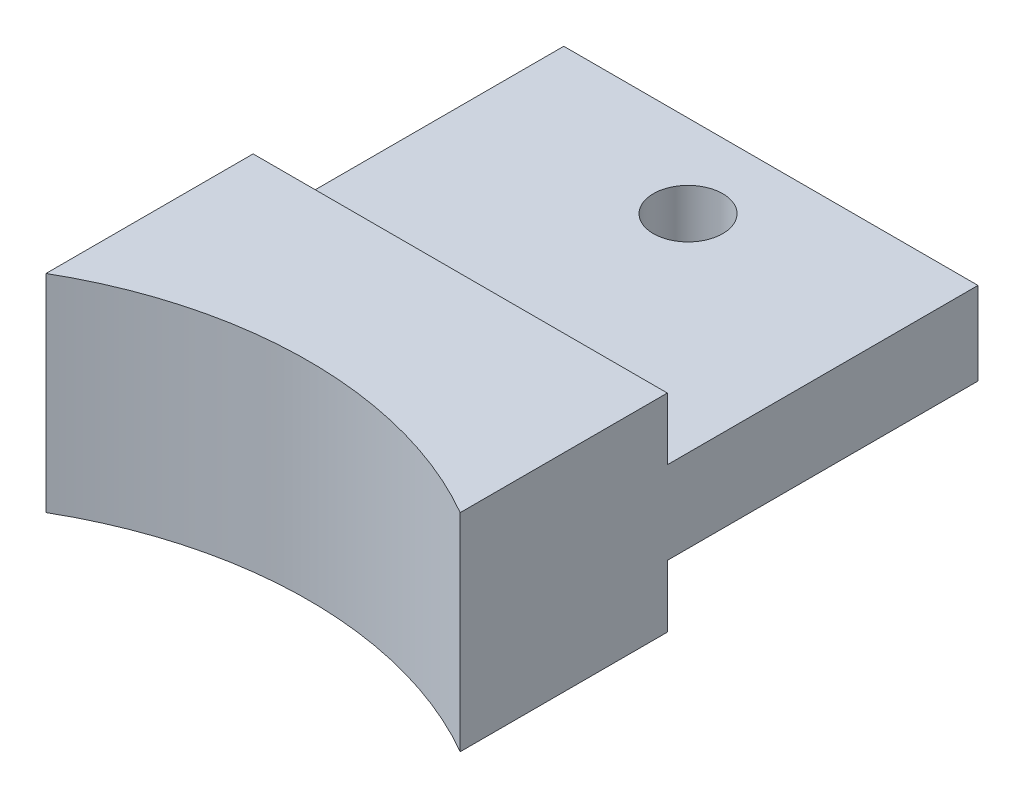
ISO-10303-21;
HEADER;
FILE_DESCRIPTION(('STEP AP214'),'2;1');
FILE_NAME('part.step','',(''),(''),'','','');
FILE_SCHEMA(('AUTOMOTIVE_DESIGN { 1 0 10303 214 1 1 1 1 }'));
ENDSEC;
DATA;
#1=APPLICATION_CONTEXT('core data for automotive mechanical design processes');
#2=APPLICATION_PROTOCOL_DEFINITION('international standard','automotive_design',2000,#1);
#3=PRODUCT_CONTEXT('',#1,'mechanical');
#4=PRODUCT('Part','Part','',(#3));
#5=PRODUCT_RELATED_PRODUCT_CATEGORY('part','',(#4));
#6=PRODUCT_DEFINITION_FORMATION('','',#4);
#7=PRODUCT_DEFINITION_CONTEXT('part definition',#1,'design');
#8=PRODUCT_DEFINITION('design','',#6,#7);
#9=PRODUCT_DEFINITION_SHAPE('','',#8);
#10=(LENGTH_UNIT() NAMED_UNIT(*) SI_UNIT(.MILLI.,.METRE.));
#11=(NAMED_UNIT(*) PLANE_ANGLE_UNIT() SI_UNIT($,.RADIAN.));
#12=(NAMED_UNIT(*) SI_UNIT($,.STERADIAN.) SOLID_ANGLE_UNIT());
#13=UNCERTAINTY_MEASURE_WITH_UNIT(LENGTH_MEASURE(1.E-05),#10,'distance_accuracy_value','');
#14=(GEOMETRIC_REPRESENTATION_CONTEXT(3) GLOBAL_UNCERTAINTY_ASSIGNED_CONTEXT((#13)) GLOBAL_UNIT_ASSIGNED_CONTEXT((#10,
#11,#12)) REPRESENTATION_CONTEXT('',''));
#15=CARTESIAN_POINT('',(0.,0.,0.));
#16=DIRECTION('',(0.,0.,1.));
#17=DIRECTION('',(1.,0.,0.));
#18=AXIS2_PLACEMENT_3D('',#15,#16,#17);
#19=CARTESIAN_POINT('',(0.,0.,0.));
#20=DIRECTION('',(0.,0.,-1.));
#21=DIRECTION('',(-1.,0.,0.));
#22=AXIS2_PLACEMENT_3D('',#19,#20,#21);
#23=PLANE('',#22);
#24=DIRECTION('',(0.,1.,0.));
#25=VECTOR('',#24,1.);
#26=CARTESIAN_POINT('',(10.,-5.,0.));
#27=LINE('',#26,#25);
#28=CARTESIAN_POINT('',(10.,2.,0.));
#29=VERTEX_POINT('',#28);
#30=CARTESIAN_POINT('',(10.,5.,0.));
#31=VERTEX_POINT('',#30);
#32=EDGE_CURVE('E60',#29,#31,#27,.T.);
#33=ORIENTED_EDGE('',*,*,#32,.F.);
#34=DIRECTION('',(-1.,0.,0.));
#35=VECTOR('',#34,1.);
#36=CARTESIAN_POINT('',(10.,2.,0.));
#37=LINE('',#36,#35);
#38=CARTESIAN_POINT('',(-10.,2.,0.));
#39=VERTEX_POINT('',#38);
#40=EDGE_CURVE('E55',#29,#39,#37,.T.);
#41=ORIENTED_EDGE('',*,*,#40,.T.);
#42=DIRECTION('',(0.,-1.,0.));
#43=VECTOR('',#42,1.);
#44=CARTESIAN_POINT('',(-10.,-5.,0.));
#45=LINE('',#44,#43);
#46=CARTESIAN_POINT('',(-10.,5.,0.));
#47=VERTEX_POINT('',#46);
#48=EDGE_CURVE('E173',#47,#39,#45,.T.);
#49=ORIENTED_EDGE('',*,*,#48,.F.);
#50=DIRECTION('',(-1.,0.,0.));
#51=VECTOR('',#50,1.);
#52=CARTESIAN_POINT('',(-10.,5.,0.));
#53=LINE('',#52,#51);
#54=EDGE_CURVE('E169',#31,#47,#53,.T.);
#55=ORIENTED_EDGE('',*,*,#54,.F.);
#56=EDGE_LOOP('',(#33,#41,#49,#55));
#57=FACE_BOUND('',#56,.T.);
#58=ADVANCED_FACE('F39',(#57),#23,.T.);
#59=CARTESIAN_POINT('',(10.,-5.,10.));
#60=DIRECTION('',(-1.,0.,0.));
#61=DIRECTION('',(0.,0.,1.));
#62=AXIS2_PLACEMENT_3D('',#59,#60,#61);
#63=PLANE('',#62);
#64=CARTESIAN_POINT('',(10.,-5.,0.));
#65=VERTEX_POINT('',#64);
#66=CARTESIAN_POINT('',(10.,-2.,0.));
#67=VERTEX_POINT('',#66);
#68=EDGE_CURVE('E166',#65,#67,#27,.T.);
#69=ORIENTED_EDGE('',*,*,#68,.T.);
#70=DIRECTION('',(0.,0.,1.));
#71=VECTOR('',#70,1.);
#72=CARTESIAN_POINT('',(10.,-2.,-15.));
#73=LINE('',#72,#71);
#74=CARTESIAN_POINT('',(10.,-2.,-15.));
#75=VERTEX_POINT('',#74);
#76=EDGE_CURVE('E126',#75,#67,#73,.T.);
#77=ORIENTED_EDGE('',*,*,#76,.F.);
#78=DIRECTION('',(0.,1.,0.));
#79=VECTOR('',#78,1.);
#80=CARTESIAN_POINT('',(10.,-2.,-15.));
#81=LINE('',#80,#79);
#82=CARTESIAN_POINT('',(10.,2.,-15.));
#83=VERTEX_POINT('',#82);
#84=EDGE_CURVE('E118',#75,#83,#81,.T.);
#85=ORIENTED_EDGE('',*,*,#84,.T.);
#86=DIRECTION('',(0.,0.,1.));
#87=VECTOR('',#86,1.);
#88=CARTESIAN_POINT('',(10.,2.,-15.));
#89=LINE('',#88,#87);
#90=EDGE_CURVE('E104',#83,#29,#89,.T.);
#91=ORIENTED_EDGE('',*,*,#90,.T.);
#92=ORIENTED_EDGE('',*,*,#32,.T.);
#93=DIRECTION('',(0.,0.,-1.));
#94=VECTOR('',#93,1.);
#95=CARTESIAN_POINT('',(10.,5.,10.));
#96=LINE('',#95,#94);
#97=CARTESIAN_POINT('',(10.,5.,10.));
#98=VERTEX_POINT('',#97);
#99=EDGE_CURVE('E11',#98,#31,#96,.T.);
#100=ORIENTED_EDGE('',*,*,#99,.F.);
#101=DIRECTION('',(0.,1.,0.));
#102=VECTOR('',#101,1.);
#103=CARTESIAN_POINT('',(10.,-5.,10.));
#104=LINE('',#103,#102);
#105=CARTESIAN_POINT('',(10.,-5.,10.));
#106=VERTEX_POINT('',#105);
#107=EDGE_CURVE('E158',#106,#98,#104,.T.);
#108=ORIENTED_EDGE('',*,*,#107,.F.);
#109=DIRECTION('',(0.,0.,-1.));
#110=VECTOR('',#109,1.);
#111=CARTESIAN_POINT('',(10.,-5.,10.));
#112=LINE('',#111,#110);
#113=EDGE_CURVE('E165',#106,#65,#112,.T.);
#114=ORIENTED_EDGE('',*,*,#113,.T.);
#115=EDGE_LOOP('',(#69,#77,#85,#91,#92,#100,#108,#114));
#116=FACE_BOUND('',#115,.T.);
#117=ADVANCED_FACE('F41',(#116),#63,.F.);
#118=CARTESIAN_POINT('',(-10.,5.,10.));
#119=DIRECTION('',(0.,-1.,0.));
#120=DIRECTION('',(0.,0.,-1.));
#121=AXIS2_PLACEMENT_3D('',#118,#119,#120);
#122=PLANE('',#121);
#123=DIRECTION('',(0.,0.,-1.));
#124=VECTOR('',#123,1.);
#125=CARTESIAN_POINT('',(-10.,5.,10.));
#126=LINE('',#125,#124);
#127=CARTESIAN_POINT('',(-10.,5.,10.));
#128=VERTEX_POINT('',#127);
#129=EDGE_CURVE('E48',#128,#47,#126,.T.);
#130=ORIENTED_EDGE('',*,*,#129,.F.);
#131=CARTESIAN_POINT('',(0.,5.,27.3205080756888));
#132=DIRECTION('',(0.,1.,0.));
#133=DIRECTION('',(0.,0.,-1.));
#134=AXIS2_PLACEMENT_3D('',#131,#132,#133);
#135=CIRCLE('',#134,20.);
#136=EDGE_CURVE('E146',#98,#128,#135,.T.);
#137=ORIENTED_EDGE('',*,*,#136,.F.);
#138=ORIENTED_EDGE('',*,*,#99,.T.);
#139=ORIENTED_EDGE('',*,*,#54,.T.);
#140=EDGE_LOOP('',(#130,#137,#138,#139));
#141=FACE_BOUND('',#140,.T.);
#142=ADVANCED_FACE('F194',(#141),#122,.F.);
#143=CARTESIAN_POINT('',(-10.,-5.,10.));
#144=DIRECTION('',(1.,0.,0.));
#145=DIRECTION('',(0.,0.,-1.));
#146=AXIS2_PLACEMENT_3D('',#143,#144,#145);
#147=PLANE('',#146);
#148=ORIENTED_EDGE('',*,*,#48,.T.);
#149=DIRECTION('',(0.,0.,1.));
#150=VECTOR('',#149,1.);
#151=CARTESIAN_POINT('',(-10.,2.,-15.));
#152=LINE('',#151,#150);
#153=CARTESIAN_POINT('',(-10.,2.,-15.));
#154=VERTEX_POINT('',#153);
#155=EDGE_CURVE('E112',#154,#39,#152,.T.);
#156=ORIENTED_EDGE('',*,*,#155,.F.);
#157=DIRECTION('',(0.,1.,0.));
#158=VECTOR('',#157,1.);
#159=CARTESIAN_POINT('',(-10.,-2.,-15.));
#160=LINE('',#159,#158);
#161=CARTESIAN_POINT('',(-10.,-2.,-15.));
#162=VERTEX_POINT('',#161);
#163=EDGE_CURVE('E120',#162,#154,#160,.T.);
#164=ORIENTED_EDGE('',*,*,#163,.F.);
#165=DIRECTION('',(0.,0.,1.));
#166=VECTOR('',#165,1.);
#167=CARTESIAN_POINT('',(-10.,-2.,-15.));
#168=LINE('',#167,#166);
#169=CARTESIAN_POINT('',(-10.,-2.,0.));
#170=VERTEX_POINT('',#169);
#171=EDGE_CURVE('E147',#162,#170,#168,.T.);
#172=ORIENTED_EDGE('',*,*,#171,.T.);
#173=CARTESIAN_POINT('',(-10.,-5.,0.));
#174=VERTEX_POINT('',#173);
#175=EDGE_CURVE('E172',#170,#174,#45,.T.);
#176=ORIENTED_EDGE('',*,*,#175,.T.);
#177=DIRECTION('',(0.,0.,-1.));
#178=VECTOR('',#177,1.);
#179=CARTESIAN_POINT('',(-10.,-5.,10.));
#180=LINE('',#179,#178);
#181=CARTESIAN_POINT('',(-10.,-5.,10.));
#182=VERTEX_POINT('',#181);
#183=EDGE_CURVE('E181',#182,#174,#180,.T.);
#184=ORIENTED_EDGE('',*,*,#183,.F.);
#185=DIRECTION('',(0.,-1.,0.));
#186=VECTOR('',#185,1.);
#187=CARTESIAN_POINT('',(-10.,-5.,10.));
#188=LINE('',#187,#186);
#189=EDGE_CURVE('E161',#128,#182,#188,.T.);
#190=ORIENTED_EDGE('',*,*,#189,.F.);
#191=ORIENTED_EDGE('',*,*,#129,.T.);
#192=EDGE_LOOP('',(#148,#156,#164,#172,#176,#184,#190,#191));
#193=FACE_BOUND('',#192,.T.);
#194=ADVANCED_FACE('F189',(#193),#147,.F.);
#195=CARTESIAN_POINT('',(-10.,-5.,10.));
#196=DIRECTION('',(0.,1.,0.));
#197=DIRECTION('',(0.,0.,1.));
#198=AXIS2_PLACEMENT_3D('',#195,#196,#197);
#199=PLANE('',#198);
#200=ORIENTED_EDGE('',*,*,#113,.F.);
#201=CARTESIAN_POINT('',(0.,-5.,27.3205080756888));
#202=DIRECTION('',(0.,1.,0.));
#203=DIRECTION('',(0.,0.,1.));
#204=AXIS2_PLACEMENT_3D('',#201,#202,#203);
#205=CIRCLE('',#204,20.);
#206=EDGE_CURVE('E153',#182,#106,#205,.F.);
#207=ORIENTED_EDGE('',*,*,#206,.F.);
#208=ORIENTED_EDGE('',*,*,#183,.T.);
#209=DIRECTION('',(1.,0.,0.));
#210=VECTOR('',#209,1.);
#211=CARTESIAN_POINT('',(-10.,-5.,0.));
#212=LINE('',#211,#210);
#213=EDGE_CURVE('E162',#174,#65,#212,.T.);
#214=ORIENTED_EDGE('',*,*,#213,.T.);
#215=EDGE_LOOP('',(#200,#207,#208,#214));
#216=FACE_BOUND('',#215,.T.);
#217=ADVANCED_FACE('F204',(#216),#199,.F.);
#218=DIRECTION('',(-1.,0.,0.));
#219=VECTOR('',#218,1.);
#220=CARTESIAN_POINT('',(10.,-2.,0.));
#221=LINE('',#220,#219);
#222=EDGE_CURVE('E129',#67,#170,#221,.T.);
#223=ORIENTED_EDGE('',*,*,#222,.F.);
#224=ORIENTED_EDGE('',*,*,#68,.F.);
#225=ORIENTED_EDGE('',*,*,#213,.F.);
#226=ORIENTED_EDGE('',*,*,#175,.F.);
#227=EDGE_LOOP('',(#223,#224,#225,#226));
#228=FACE_BOUND('',#227,.T.);
#229=ADVANCED_FACE('F206',(#228),#23,.T.);
#230=CARTESIAN_POINT('',(0.,-25.1786936388967,27.3205080756888));
#231=DIRECTION('',(0.,1.,0.));
#232=DIRECTION('',(0.,0.,1.));
#233=AXIS2_PLACEMENT_3D('',#230,#231,#232);
#234=CYLINDRICAL_SURFACE('',#233,20.);
#235=ORIENTED_EDGE('',*,*,#206,.T.);
#236=ORIENTED_EDGE('',*,*,#107,.T.);
#237=ORIENTED_EDGE('',*,*,#136,.T.);
#238=ORIENTED_EDGE('',*,*,#189,.T.);
#239=EDGE_LOOP('',(#235,#236,#237,#238));
#240=FACE_BOUND('',#239,.T.);
#241=ADVANCED_FACE('F210',(#240),#234,.F.);
#242=CARTESIAN_POINT('',(10.,-2.,-15.));
#243=DIRECTION('',(0.,1.,0.));
#244=DIRECTION('',(0.,0.,1.));
#245=AXIS2_PLACEMENT_3D('',#242,#243,#244);
#246=PLANE('',#245);
#247=CARTESIAN_POINT('',(0.,-2.,-11.));
#248=DIRECTION('',(0.,1.,0.));
#249=DIRECTION('',(0.,0.,1.));
#250=AXIS2_PLACEMENT_3D('',#247,#248,#249);
#251=CIRCLE('',#250,1.675);
#252=CARTESIAN_POINT('',(0.,-2.,-9.325));
#253=VERTEX_POINT('',#252);
#254=EDGE_CURVE('E135',#253,#253,#251,.T.);
#255=ORIENTED_EDGE('',*,*,#254,.T.);
#256=EDGE_LOOP('',(#255));
#257=FACE_BOUND('',#256,.T.);
#258=ORIENTED_EDGE('',*,*,#222,.T.);
#259=ORIENTED_EDGE('',*,*,#171,.F.);
#260=DIRECTION('',(-1.,0.,0.));
#261=VECTOR('',#260,1.);
#262=CARTESIAN_POINT('',(10.,-2.,-15.));
#263=LINE('',#262,#261);
#264=EDGE_CURVE('E113',#75,#162,#263,.T.);
#265=ORIENTED_EDGE('',*,*,#264,.F.);
#266=ORIENTED_EDGE('',*,*,#76,.T.);
#267=EDGE_LOOP('',(#258,#259,#265,#266));
#268=FACE_BOUND('',#267,.T.);
#269=ADVANCED_FACE('F208',(#257,#268),#246,.F.);
#270=CARTESIAN_POINT('',(10.,2.,-15.));
#271=DIRECTION('',(0.,1.,0.));
#272=DIRECTION('',(0.,0.,1.));
#273=AXIS2_PLACEMENT_3D('',#270,#271,#272);
#274=PLANE('',#273);
#275=CARTESIAN_POINT('',(0.,2.,-11.));
#276=DIRECTION('',(0.,1.,0.));
#277=DIRECTION('',(0.,0.,1.));
#278=AXIS2_PLACEMENT_3D('',#275,#276,#277);
#279=CIRCLE('',#278,1.675);
#280=CARTESIAN_POINT('',(0.,2.,-9.325));
#281=VERTEX_POINT('',#280);
#282=EDGE_CURVE('E290',#281,#281,#279,.T.);
#283=ORIENTED_EDGE('',*,*,#282,.F.);
#284=EDGE_LOOP('',(#283));
#285=FACE_BOUND('',#284,.T.);
#286=ORIENTED_EDGE('',*,*,#40,.F.);
#287=ORIENTED_EDGE('',*,*,#90,.F.);
#288=DIRECTION('',(-1.,0.,0.));
#289=VECTOR('',#288,1.);
#290=CARTESIAN_POINT('',(10.,2.,-15.));
#291=LINE('',#290,#289);
#292=EDGE_CURVE('E108',#83,#154,#291,.T.);
#293=ORIENTED_EDGE('',*,*,#292,.T.);
#294=ORIENTED_EDGE('',*,*,#155,.T.);
#295=EDGE_LOOP('',(#286,#287,#293,#294));
#296=FACE_BOUND('',#295,.T.);
#297=ADVANCED_FACE('F106',(#285,#296),#274,.T.);
#298=CARTESIAN_POINT('',(0.,0.,-15.));
#299=DIRECTION('',(0.,0.,1.));
#300=DIRECTION('',(1.,0.,0.));
#301=AXIS2_PLACEMENT_3D('',#298,#299,#300);
#302=PLANE('',#301);
#303=ORIENTED_EDGE('',*,*,#84,.F.);
#304=ORIENTED_EDGE('',*,*,#264,.T.);
#305=ORIENTED_EDGE('',*,*,#163,.T.);
#306=ORIENTED_EDGE('',*,*,#292,.F.);
#307=EDGE_LOOP('',(#303,#304,#305,#306));
#308=FACE_BOUND('',#307,.T.);
#309=ADVANCED_FACE('F117',(#308),#302,.F.);
#310=CARTESIAN_POINT('',(0.,2.,-11.));
#311=DIRECTION('',(0.,1.,0.));
#312=DIRECTION('',(0.,0.,1.));
#313=AXIS2_PLACEMENT_3D('',#310,#311,#312);
#314=CYLINDRICAL_SURFACE('',#313,1.675);
#315=ORIENTED_EDGE('',*,*,#254,.F.);
#316=EDGE_LOOP('',(#315));
#317=FACE_BOUND('',#316,.T.);
#318=ORIENTED_EDGE('',*,*,#282,.T.);
#319=EDGE_LOOP('',(#318));
#320=FACE_BOUND('',#319,.T.);
#321=ADVANCED_FACE('F264',(#317,#320),#314,.F.);
#322=CLOSED_SHELL('',(#58,#117,#142,#194,#217,#229,#241,#269,#297,#309,#321));
#323=MANIFOLD_SOLID_BREP('B2',#322);
#324=ADVANCED_BREP_SHAPE_REPRESENTATION('',(#18,#323),#14);
#325=SHAPE_DEFINITION_REPRESENTATION(#9,#324);
ENDSEC;
END-ISO-10303-21;
